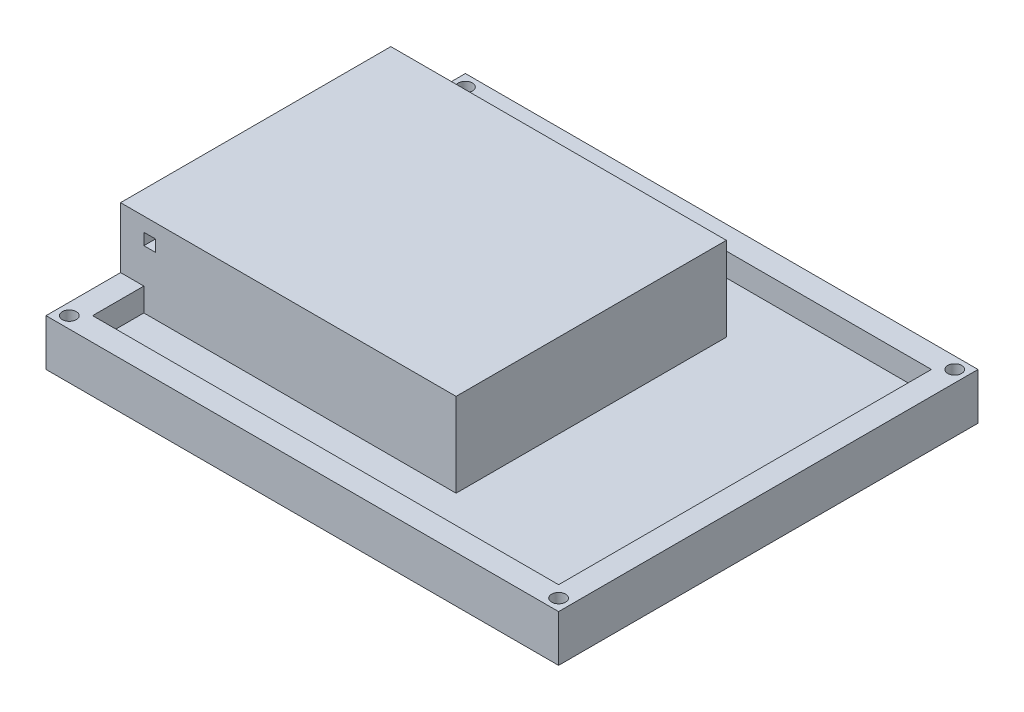
ISO-10303-21;
HEADER;
FILE_DESCRIPTION(('STEP AP214'),'2;1');
FILE_NAME('part.step','',(''),(''),'','','');
FILE_SCHEMA(('AUTOMOTIVE_DESIGN { 1 0 10303 214 1 1 1 1 }'));
ENDSEC;
DATA;
#1=APPLICATION_CONTEXT('core data for automotive mechanical design processes');
#2=APPLICATION_PROTOCOL_DEFINITION('international standard','automotive_design',2000,#1);
#3=PRODUCT_CONTEXT('',#1,'mechanical');
#4=PRODUCT('Part','Part','',(#3));
#5=PRODUCT_RELATED_PRODUCT_CATEGORY('part','',(#4));
#6=PRODUCT_DEFINITION_FORMATION('','',#4);
#7=PRODUCT_DEFINITION_CONTEXT('part definition',#1,'design');
#8=PRODUCT_DEFINITION('design','',#6,#7);
#9=PRODUCT_DEFINITION_SHAPE('','',#8);
#10=(LENGTH_UNIT() NAMED_UNIT(*) SI_UNIT(.MILLI.,.METRE.));
#11=(NAMED_UNIT(*) PLANE_ANGLE_UNIT() SI_UNIT($,.RADIAN.));
#12=(NAMED_UNIT(*) SI_UNIT($,.STERADIAN.) SOLID_ANGLE_UNIT());
#13=UNCERTAINTY_MEASURE_WITH_UNIT(LENGTH_MEASURE(1.E-05),#10,'distance_accuracy_value','');
#14=(GEOMETRIC_REPRESENTATION_CONTEXT(3) GLOBAL_UNCERTAINTY_ASSIGNED_CONTEXT((#13)) GLOBAL_UNIT_ASSIGNED_CONTEXT((#10,
#11,#12)) REPRESENTATION_CONTEXT('',''));
#15=CARTESIAN_POINT('',(0.,0.,0.));
#16=DIRECTION('',(0.,0.,1.));
#17=DIRECTION('',(1.,0.,0.));
#18=AXIS2_PLACEMENT_3D('',#15,#16,#17);
#19=CARTESIAN_POINT('',(0.,30.,29.));
#20=DIRECTION('',(0.,0.,1.));
#21=DIRECTION('',(1.,0.,0.));
#22=AXIS2_PLACEMENT_3D('',#19,#20,#21);
#23=PLANE('',#22);
#24=DIRECTION('',(1.,0.,0.));
#25=VECTOR('',#24,1.);
#26=CARTESIAN_POINT('',(15.,10.,29.));
#27=LINE('',#26,#25);
#28=CARTESIAN_POINT('',(-55.,10.,29.));
#29=VERTEX_POINT('',#28);
#30=CARTESIAN_POINT('',(-50.,10.,29.));
#31=VERTEX_POINT('',#30);
#32=EDGE_CURVE('E233',#29,#31,#27,.T.);
#33=ORIENTED_EDGE('',*,*,#32,.T.);
#34=DIRECTION('',(0.,-1.,0.));
#35=VECTOR('',#34,1.);
#36=CARTESIAN_POINT('',(-50.,10.,29.));
#37=LINE('',#36,#35);
#38=CARTESIAN_POINT('',(-50.,5.,29.));
#39=VERTEX_POINT('',#38);
#40=EDGE_CURVE('E259',#31,#39,#37,.T.);
#41=ORIENTED_EDGE('',*,*,#40,.T.);
#42=DIRECTION('',(-1.,0.,0.));
#43=VECTOR('',#42,1.);
#44=CARTESIAN_POINT('',(0.,5.,29.));
#45=LINE('',#44,#43);
#46=CARTESIAN_POINT('',(17.,5.,29.));
#47=VERTEX_POINT('',#46);
#48=EDGE_CURVE('E325',#47,#39,#45,.T.);
#49=ORIENTED_EDGE('',*,*,#48,.F.);
#50=DIRECTION('',(0.,-1.,0.));
#51=VECTOR('',#50,1.);
#52=CARTESIAN_POINT('',(17.,30.,29.));
#53=LINE('',#52,#51);
#54=CARTESIAN_POINT('',(17.,23.,29.));
#55=VERTEX_POINT('',#54);
#56=EDGE_CURVE('E338',#55,#47,#53,.T.);
#57=ORIENTED_EDGE('',*,*,#56,.F.);
#58=DIRECTION('',(1.,0.,0.));
#59=VECTOR('',#58,1.);
#60=CARTESIAN_POINT('',(15.,23.,29.));
#61=LINE('',#60,#59);
#62=CARTESIAN_POINT('',(-55.,23.,29.));
#63=VERTEX_POINT('',#62);
#64=EDGE_CURVE('E237',#63,#55,#61,.T.);
#65=ORIENTED_EDGE('',*,*,#64,.F.);
#66=DIRECTION('',(0.,-1.,0.));
#67=VECTOR('',#66,1.);
#68=CARTESIAN_POINT('',(-55.,23.,29.));
#69=LINE('',#68,#67);
#70=EDGE_CURVE('E235',#63,#29,#69,.T.);
#71=ORIENTED_EDGE('',*,*,#70,.T.);
#72=EDGE_LOOP('',(#33,#41,#49,#57,#65,#71));
#73=FACE_BOUND('',#72,.T.);
#74=DIRECTION('',(0.,-1.,0.));
#75=VECTOR('',#74,1.);
#76=CARTESIAN_POINT('',(-50.,0.,29.));
#77=LINE('',#76,#75);
#78=CARTESIAN_POINT('',(-50.,20.,29.));
#79=VERTEX_POINT('',#78);
#80=CARTESIAN_POINT('',(-50.,17.5,29.));
#81=VERTEX_POINT('',#80);
#82=EDGE_CURVE('E189',#79,#81,#77,.T.);
#83=ORIENTED_EDGE('',*,*,#82,.F.);
#84=DIRECTION('',(1.,0.,0.));
#85=VECTOR('',#84,1.);
#86=CARTESIAN_POINT('',(0.,20.,29.));
#87=LINE('',#86,#85);
#88=CARTESIAN_POINT('',(-47.5,20.,29.));
#89=VERTEX_POINT('',#88);
#90=EDGE_CURVE('E52',#79,#89,#87,.T.);
#91=ORIENTED_EDGE('',*,*,#90,.T.);
#92=DIRECTION('',(0.,-1.,0.));
#93=VECTOR('',#92,1.);
#94=CARTESIAN_POINT('',(-47.5,0.,29.));
#95=LINE('',#94,#93);
#96=CARTESIAN_POINT('',(-47.5,17.5,29.));
#97=VERTEX_POINT('',#96);
#98=EDGE_CURVE('E209',#89,#97,#95,.T.);
#99=ORIENTED_EDGE('',*,*,#98,.T.);
#100=DIRECTION('',(1.,0.,0.));
#101=VECTOR('',#100,1.);
#102=CARTESIAN_POINT('',(0.,17.5,29.));
#103=LINE('',#102,#101);
#104=EDGE_CURVE('E212',#81,#97,#103,.T.);
#105=ORIENTED_EDGE('',*,*,#104,.F.);
#106=EDGE_LOOP('',(#83,#91,#99,#105));
#107=FACE_BOUND('',#106,.T.);
#108=ADVANCED_FACE('F35',(#73,#107),#23,.T.);
#109=CARTESIAN_POINT('',(15.,0.,26.));
#110=DIRECTION('',(0.,0.,-1.));
#111=DIRECTION('',(0.,1.,0.));
#112=AXIS2_PLACEMENT_3D('',#109,#110,#111);
#113=PLANE('',#112);
#114=DIRECTION('',(1.,0.,0.));
#115=VECTOR('',#114,1.);
#116=CARTESIAN_POINT('',(0.,17.5,26.));
#117=LINE('',#116,#115);
#118=CARTESIAN_POINT('',(-50.,17.5,26.));
#119=VERTEX_POINT('',#118);
#120=CARTESIAN_POINT('',(-47.5,17.5,26.));
#121=VERTEX_POINT('',#120);
#122=EDGE_CURVE('E198',#119,#121,#117,.T.);
#123=ORIENTED_EDGE('',*,*,#122,.T.);
#124=DIRECTION('',(0.,-1.,0.));
#125=VECTOR('',#124,1.);
#126=CARTESIAN_POINT('',(-47.5,0.,26.));
#127=LINE('',#126,#125);
#128=CARTESIAN_POINT('',(-47.5,20.,26.));
#129=VERTEX_POINT('',#128);
#130=EDGE_CURVE('E202',#129,#121,#127,.T.);
#131=ORIENTED_EDGE('',*,*,#130,.F.);
#132=DIRECTION('',(1.,0.,0.));
#133=VECTOR('',#132,1.);
#134=CARTESIAN_POINT('',(15.,20.,26.0000000000001));
#135=LINE('',#134,#133);
#136=CARTESIAN_POINT('',(15.,20.,26.0000000000001));
#137=VERTEX_POINT('',#136);
#138=EDGE_CURVE('E231',#129,#137,#135,.T.);
#139=ORIENTED_EDGE('',*,*,#138,.T.);
#140=DIRECTION('',(0.,-1.,0.));
#141=VECTOR('',#140,1.);
#142=CARTESIAN_POINT('',(15.,0.,26.));
#143=LINE('',#142,#141);
#144=CARTESIAN_POINT('',(15.,0.,26.));
#145=VERTEX_POINT('',#144);
#146=EDGE_CURVE('E311',#137,#145,#143,.T.);
#147=ORIENTED_EDGE('',*,*,#146,.T.);
#148=DIRECTION('',(-1.,0.,0.));
#149=VECTOR('',#148,1.);
#150=CARTESIAN_POINT('',(15.,0.,26.));
#151=LINE('',#150,#149);
#152=CARTESIAN_POINT('',(-55.,0.,26.));
#153=VERTEX_POINT('',#152);
#154=EDGE_CURVE('E322',#145,#153,#151,.T.);
#155=ORIENTED_EDGE('',*,*,#154,.T.);
#156=DIRECTION('',(0.,-1.,0.));
#157=VECTOR('',#156,1.);
#158=CARTESIAN_POINT('',(-55.,0.,26.));
#159=LINE('',#158,#157);
#160=CARTESIAN_POINT('',(-55.,20.,26.0000000000001));
#161=VERTEX_POINT('',#160);
#162=EDGE_CURVE('E310',#161,#153,#159,.T.);
#163=ORIENTED_EDGE('',*,*,#162,.F.);
#164=CARTESIAN_POINT('',(-50.,20.,26.0000000000001));
#165=VERTEX_POINT('',#164);
#166=EDGE_CURVE('E208',#161,#165,#135,.T.);
#167=ORIENTED_EDGE('',*,*,#166,.T.);
#168=DIRECTION('',(0.,-1.,0.));
#169=VECTOR('',#168,1.);
#170=CARTESIAN_POINT('',(-50.,0.,26.));
#171=LINE('',#170,#169);
#172=EDGE_CURVE('E59',#165,#119,#171,.T.);
#173=ORIENTED_EDGE('',*,*,#172,.T.);
#174=EDGE_LOOP('',(#123,#131,#139,#147,#155,#163,#167,#173));
#175=FACE_BOUND('',#174,.T.);
#176=ADVANCED_FACE('F205',(#175),#113,.T.);
#177=CARTESIAN_POINT('',(55.,10.,-45.));
#178=DIRECTION('',(0.,-1.,0.));
#179=DIRECTION('',(0.,0.,-1.));
#180=AXIS2_PLACEMENT_3D('',#177,#178,#179);
#181=PLANE('',#180);
#182=CARTESIAN_POINT('',(-52.5,10.,42.5));
#183=DIRECTION('',(0.,-1.,0.));
#184=DIRECTION('',(0.,0.,-1.));
#185=AXIS2_PLACEMENT_3D('',#182,#183,#184);
#186=CIRCLE('',#185,1.5);
#187=CARTESIAN_POINT('',(-52.5,10.,41.));
#188=VERTEX_POINT('',#187);
#189=EDGE_CURVE('E277',#188,#188,#186,.F.);
#190=ORIENTED_EDGE('',*,*,#189,.F.);
#191=EDGE_LOOP('',(#190));
#192=FACE_BOUND('',#191,.T.);
#193=CARTESIAN_POINT('',(52.5,10.,42.5));
#194=DIRECTION('',(0.,-1.,0.));
#195=DIRECTION('',(0.,0.,-1.));
#196=AXIS2_PLACEMENT_3D('',#193,#194,#195);
#197=CIRCLE('',#196,1.5);
#198=CARTESIAN_POINT('',(52.5,10.,41.));
#199=VERTEX_POINT('',#198);
#200=EDGE_CURVE('E284',#199,#199,#197,.F.);
#201=ORIENTED_EDGE('',*,*,#200,.F.);
#202=EDGE_LOOP('',(#201));
#203=FACE_BOUND('',#202,.T.);
#204=CARTESIAN_POINT('',(52.5,10.,-42.5));
#205=DIRECTION('',(0.,-1.,0.));
#206=DIRECTION('',(0.,0.,-1.));
#207=AXIS2_PLACEMENT_3D('',#204,#205,#206);
#208=CIRCLE('',#207,1.5);
#209=CARTESIAN_POINT('',(52.5,10.,-44.));
#210=VERTEX_POINT('',#209);
#211=EDGE_CURVE('E295',#210,#210,#208,.F.);
#212=ORIENTED_EDGE('',*,*,#211,.F.);
#213=EDGE_LOOP('',(#212));
#214=FACE_BOUND('',#213,.T.);
#215=CARTESIAN_POINT('',(-52.5,10.,-42.5));
#216=DIRECTION('',(0.,-1.,0.));
#217=DIRECTION('',(0.,0.,-1.));
#218=AXIS2_PLACEMENT_3D('',#215,#216,#217);
#219=CIRCLE('',#218,1.5);
#220=CARTESIAN_POINT('',(-52.5,10.,-44.));
#221=VERTEX_POINT('',#220);
#222=EDGE_CURVE('E39',#221,#221,#219,.F.);
#223=ORIENTED_EDGE('',*,*,#222,.F.);
#224=EDGE_LOOP('',(#223));
#225=FACE_BOUND('',#224,.T.);
#226=ORIENTED_EDGE('',*,*,#32,.F.);
#227=DIRECTION('',(0.,0.,-1.));
#228=VECTOR('',#227,1.);
#229=CARTESIAN_POINT('',(-55.,10.,45.));
#230=LINE('',#229,#228);
#231=CARTESIAN_POINT('',(-55.,10.,45.));
#232=VERTEX_POINT('',#231);
#233=EDGE_CURVE('E272',#232,#29,#230,.T.);
#234=ORIENTED_EDGE('',*,*,#233,.F.);
#235=DIRECTION('',(-1.,0.,0.));
#236=VECTOR('',#235,1.);
#237=CARTESIAN_POINT('',(55.,10.,45.));
#238=LINE('',#237,#236);
#239=CARTESIAN_POINT('',(55.,10.,45.));
#240=VERTEX_POINT('',#239);
#241=EDGE_CURVE('E280',#240,#232,#238,.T.);
#242=ORIENTED_EDGE('',*,*,#241,.F.);
#243=DIRECTION('',(0.,0.,1.));
#244=VECTOR('',#243,1.);
#245=CARTESIAN_POINT('',(55.,10.,-45.));
#246=LINE('',#245,#244);
#247=CARTESIAN_POINT('',(55.,10.,-45.));
#248=VERTEX_POINT('',#247);
#249=EDGE_CURVE('E288',#248,#240,#246,.T.);
#250=ORIENTED_EDGE('',*,*,#249,.F.);
#251=DIRECTION('',(-1.,0.,0.));
#252=VECTOR('',#251,1.);
#253=CARTESIAN_POINT('',(55.,10.,-45.));
#254=LINE('',#253,#252);
#255=CARTESIAN_POINT('',(-55.,10.,-45.));
#256=VERTEX_POINT('',#255);
#257=EDGE_CURVE('E290',#248,#256,#254,.T.);
#258=ORIENTED_EDGE('',*,*,#257,.T.);
#259=DIRECTION('',(0.,0.,1.));
#260=VECTOR('',#259,1.);
#261=CARTESIAN_POINT('',(-55.,10.,-45.));
#262=LINE('',#261,#260);
#263=CARTESIAN_POINT('',(-55.,10.,-29.));
#264=VERTEX_POINT('',#263);
#265=EDGE_CURVE('E287',#256,#264,#262,.T.);
#266=ORIENTED_EDGE('',*,*,#265,.T.);
#267=DIRECTION('',(-1.,0.,0.));
#268=VECTOR('',#267,1.);
#269=CARTESIAN_POINT('',(17.,10.,-29.));
#270=LINE('',#269,#268);
#271=CARTESIAN_POINT('',(-50.,10.,-29.));
#272=VERTEX_POINT('',#271);
#273=EDGE_CURVE('E11',#272,#264,#270,.T.);
#274=ORIENTED_EDGE('',*,*,#273,.F.);
#275=DIRECTION('',(0.,0.,-1.));
#276=VECTOR('',#275,1.);
#277=CARTESIAN_POINT('',(-50.,10.,-40.));
#278=LINE('',#277,#276);
#279=CARTESIAN_POINT('',(-50.,10.,-40.));
#280=VERTEX_POINT('',#279);
#281=EDGE_CURVE('E262',#272,#280,#278,.T.);
#282=ORIENTED_EDGE('',*,*,#281,.T.);
#283=DIRECTION('',(-1.,0.,0.));
#284=VECTOR('',#283,1.);
#285=CARTESIAN_POINT('',(55.,10.,-40.));
#286=LINE('',#285,#284);
#287=CARTESIAN_POINT('',(50.,10.,-40.));
#288=VERTEX_POINT('',#287);
#289=EDGE_CURVE('E292',#288,#280,#286,.T.);
#290=ORIENTED_EDGE('',*,*,#289,.F.);
#291=DIRECTION('',(0.,0.,-1.));
#292=VECTOR('',#291,1.);
#293=CARTESIAN_POINT('',(50.,10.,45.));
#294=LINE('',#293,#292);
#295=CARTESIAN_POINT('',(50.,10.,40.));
#296=VERTEX_POINT('',#295);
#297=EDGE_CURVE('E282',#296,#288,#294,.T.);
#298=ORIENTED_EDGE('',*,*,#297,.F.);
#299=DIRECTION('',(1.,0.,0.));
#300=VECTOR('',#299,1.);
#301=CARTESIAN_POINT('',(-55.,10.,40.));
#302=LINE('',#301,#300);
#303=CARTESIAN_POINT('',(-50.,10.,40.));
#304=VERTEX_POINT('',#303);
#305=EDGE_CURVE('E275',#304,#296,#302,.T.);
#306=ORIENTED_EDGE('',*,*,#305,.F.);
#307=DIRECTION('',(0.,0.,-1.));
#308=VECTOR('',#307,1.);
#309=CARTESIAN_POINT('',(-50.,10.,29.));
#310=LINE('',#309,#308);
#311=EDGE_CURVE('E251',#304,#31,#310,.T.);
#312=ORIENTED_EDGE('',*,*,#311,.T.);
#313=EDGE_LOOP('',(#226,#234,#242,#250,#258,#266,#274,#282,#290,#298,#306,#312));
#314=FACE_BOUND('',#313,.T.);
#315=ADVANCED_FACE('F408',(#192,#203,#214,#225,#314),#181,.F.);
#316=CARTESIAN_POINT('',(15.,0.,0.));
#317=DIRECTION('',(-1.,0.,0.));
#318=DIRECTION('',(0.,0.,1.));
#319=AXIS2_PLACEMENT_3D('',#316,#317,#318);
#320=PLANE('',#319);
#321=DIRECTION('',(0.,0.,-1.));
#322=VECTOR('',#321,1.);
#323=CARTESIAN_POINT('',(15.,20.,-25.9999999999999));
#324=LINE('',#323,#322);
#325=CARTESIAN_POINT('',(15.,20.,-25.9999999999999));
#326=VERTEX_POINT('',#325);
#327=EDGE_CURVE('E221',#137,#326,#324,.T.);
#328=ORIENTED_EDGE('',*,*,#327,.T.);
#329=DIRECTION('',(0.,-1.,0.));
#330=VECTOR('',#329,1.);
#331=CARTESIAN_POINT('',(15.,0.,-25.9999999999999));
#332=LINE('',#331,#330);
#333=CARTESIAN_POINT('',(15.,0.,-25.9999999999999));
#334=VERTEX_POINT('',#333);
#335=EDGE_CURVE('E313',#326,#334,#332,.T.);
#336=ORIENTED_EDGE('',*,*,#335,.T.);
#337=DIRECTION('',(0.,0.,1.));
#338=VECTOR('',#337,1.);
#339=CARTESIAN_POINT('',(15.,0.,0.));
#340=LINE('',#339,#338);
#341=EDGE_CURVE('E316',#334,#145,#340,.T.);
#342=ORIENTED_EDGE('',*,*,#341,.T.);
#343=ORIENTED_EDGE('',*,*,#146,.F.);
#344=EDGE_LOOP('',(#328,#336,#342,#343));
#345=FACE_BOUND('',#344,.T.);
#346=ADVANCED_FACE('F399',(#345),#320,.T.);
#347=CARTESIAN_POINT('',(15.,0.,-25.9999999999999));
#348=DIRECTION('',(0.,0.,-1.));
#349=DIRECTION('',(0.,1.,0.));
#350=AXIS2_PLACEMENT_3D('',#347,#348,#349);
#351=PLANE('',#350);
#352=ORIENTED_EDGE('',*,*,#335,.F.);
#353=DIRECTION('',(-1.,0.,0.));
#354=VECTOR('',#353,1.);
#355=CARTESIAN_POINT('',(15.,20.,-25.9999999999999));
#356=LINE('',#355,#354);
#357=CARTESIAN_POINT('',(-55.,20.,-25.9999999999999));
#358=VERTEX_POINT('',#357);
#359=EDGE_CURVE('E226',#326,#358,#356,.T.);
#360=ORIENTED_EDGE('',*,*,#359,.T.);
#361=DIRECTION('',(0.,-1.,0.));
#362=VECTOR('',#361,1.);
#363=CARTESIAN_POINT('',(-55.,0.,-25.9999999999999));
#364=LINE('',#363,#362);
#365=CARTESIAN_POINT('',(-55.,0.,-25.9999999999999));
#366=VERTEX_POINT('',#365);
#367=EDGE_CURVE('E314',#358,#366,#364,.T.);
#368=ORIENTED_EDGE('',*,*,#367,.T.);
#369=DIRECTION('',(-1.,0.,0.));
#370=VECTOR('',#369,1.);
#371=CARTESIAN_POINT('',(15.,0.,-25.9999999999999));
#372=LINE('',#371,#370);
#373=EDGE_CURVE('E319',#334,#366,#372,.T.);
#374=ORIENTED_EDGE('',*,*,#373,.F.);
#375=EDGE_LOOP('',(#352,#360,#368,#374));
#376=FACE_BOUND('',#375,.T.);
#377=ADVANCED_FACE('F475',(#376),#351,.F.);
#378=CARTESIAN_POINT('',(0.,5.,0.));
#379=DIRECTION('',(0.,-1.,0.));
#380=DIRECTION('',(0.,0.,-1.));
#381=AXIS2_PLACEMENT_3D('',#378,#379,#380);
#382=PLANE('',#381);
#383=DIRECTION('',(0.,0.,-1.));
#384=VECTOR('',#383,1.);
#385=CARTESIAN_POINT('',(-50.,5.,29.));
#386=LINE('',#385,#384);
#387=CARTESIAN_POINT('',(-50.,5.,40.));
#388=VERTEX_POINT('',#387);
#389=EDGE_CURVE('E250',#388,#39,#386,.T.);
#390=ORIENTED_EDGE('',*,*,#389,.F.);
#391=DIRECTION('',(-1.,0.,0.));
#392=VECTOR('',#391,1.);
#393=CARTESIAN_POINT('',(-55.,5.,40.));
#394=LINE('',#393,#392);
#395=CARTESIAN_POINT('',(50.,5.,40.));
#396=VERTEX_POINT('',#395);
#397=EDGE_CURVE('E348',#396,#388,#394,.T.);
#398=ORIENTED_EDGE('',*,*,#397,.F.);
#399=DIRECTION('',(0.,0.,1.));
#400=VECTOR('',#399,1.);
#401=CARTESIAN_POINT('',(50.,5.,-40.));
#402=LINE('',#401,#400);
#403=CARTESIAN_POINT('',(50.,5.,-40.));
#404=VERTEX_POINT('',#403);
#405=EDGE_CURVE('E340',#404,#396,#402,.T.);
#406=ORIENTED_EDGE('',*,*,#405,.F.);
#407=DIRECTION('',(1.,0.,0.));
#408=VECTOR('',#407,1.);
#409=CARTESIAN_POINT('',(-55.,5.,-40.));
#410=LINE('',#409,#408);
#411=CARTESIAN_POINT('',(-50.,5.,-40.));
#412=VERTEX_POINT('',#411);
#413=EDGE_CURVE('E351',#412,#404,#410,.T.);
#414=ORIENTED_EDGE('',*,*,#413,.F.);
#415=DIRECTION('',(0.,0.,-1.));
#416=VECTOR('',#415,1.);
#417=CARTESIAN_POINT('',(-50.,5.,-40.));
#418=LINE('',#417,#416);
#419=CARTESIAN_POINT('',(-50.,5.,-29.));
#420=VERTEX_POINT('',#419);
#421=EDGE_CURVE('E261',#420,#412,#418,.T.);
#422=ORIENTED_EDGE('',*,*,#421,.F.);
#423=DIRECTION('',(1.,0.,0.));
#424=VECTOR('',#423,1.);
#425=CARTESIAN_POINT('',(0.,5.,-29.));
#426=LINE('',#425,#424);
#427=CARTESIAN_POINT('',(17.,5.,-29.));
#428=VERTEX_POINT('',#427);
#429=EDGE_CURVE('E333',#420,#428,#426,.T.);
#430=ORIENTED_EDGE('',*,*,#429,.T.);
#431=DIRECTION('',(0.,0.,1.));
#432=VECTOR('',#431,1.);
#433=CARTESIAN_POINT('',(17.,5.,0.));
#434=LINE('',#433,#432);
#435=EDGE_CURVE('E330',#428,#47,#434,.T.);
#436=ORIENTED_EDGE('',*,*,#435,.T.);
#437=ORIENTED_EDGE('',*,*,#48,.T.);
#438=EDGE_LOOP('',(#390,#398,#406,#414,#422,#430,#436,#437));
#439=FACE_BOUND('',#438,.T.);
#440=ADVANCED_FACE('F430',(#439),#382,.F.);
#441=CARTESIAN_POINT('',(-55.,30.,40.));
#442=DIRECTION('',(0.,0.,1.));
#443=DIRECTION('',(1.,0.,0.));
#444=AXIS2_PLACEMENT_3D('',#441,#442,#443);
#445=PLANE('',#444);
#446=DIRECTION('',(0.,-1.,0.));
#447=VECTOR('',#446,1.);
#448=CARTESIAN_POINT('',(-50.,10.,40.));
#449=LINE('',#448,#447);
#450=EDGE_CURVE('E254',#304,#388,#449,.T.);
#451=ORIENTED_EDGE('',*,*,#450,.F.);
#452=ORIENTED_EDGE('',*,*,#305,.T.);
#453=DIRECTION('',(0.,-1.,0.));
#454=VECTOR('',#453,1.);
#455=CARTESIAN_POINT('',(50.,30.,40.));
#456=LINE('',#455,#454);
#457=EDGE_CURVE('E343',#296,#396,#456,.T.);
#458=ORIENTED_EDGE('',*,*,#457,.T.);
#459=ORIENTED_EDGE('',*,*,#397,.T.);
#460=EDGE_LOOP('',(#451,#452,#458,#459));
#461=FACE_BOUND('',#460,.T.);
#462=ADVANCED_FACE('F433',(#461),#445,.F.);
#463=CARTESIAN_POINT('',(-55.,30.,-40.));
#464=DIRECTION('',(0.,0.,-1.));
#465=DIRECTION('',(-1.,0.,0.));
#466=AXIS2_PLACEMENT_3D('',#463,#464,#465);
#467=PLANE('',#466);
#468=DIRECTION('',(0.,-1.,0.));
#469=VECTOR('',#468,1.);
#470=CARTESIAN_POINT('',(-50.,10.,-40.));
#471=LINE('',#470,#469);
#472=EDGE_CURVE('E270',#280,#412,#471,.T.);
#473=ORIENTED_EDGE('',*,*,#472,.T.);
#474=ORIENTED_EDGE('',*,*,#413,.T.);
#475=DIRECTION('',(0.,-1.,0.));
#476=VECTOR('',#475,1.);
#477=CARTESIAN_POINT('',(50.,30.,-40.));
#478=LINE('',#477,#476);
#479=EDGE_CURVE('E345',#288,#404,#478,.T.);
#480=ORIENTED_EDGE('',*,*,#479,.F.);
#481=ORIENTED_EDGE('',*,*,#289,.T.);
#482=EDGE_LOOP('',(#473,#474,#480,#481));
#483=FACE_BOUND('',#482,.T.);
#484=ADVANCED_FACE('F423',(#483),#467,.F.);
#485=CARTESIAN_POINT('',(0.,30.,-29.));
#486=DIRECTION('',(0.,0.,-1.));
#487=DIRECTION('',(-1.,0.,0.));
#488=AXIS2_PLACEMENT_3D('',#485,#486,#487);
#489=PLANE('',#488);
#490=DIRECTION('',(0.,-1.,0.));
#491=VECTOR('',#490,1.);
#492=CARTESIAN_POINT('',(-50.,10.,-28.9999999999999));
#493=LINE('',#492,#491);
#494=EDGE_CURVE('E265',#272,#420,#493,.T.);
#495=ORIENTED_EDGE('',*,*,#494,.F.);
#496=ORIENTED_EDGE('',*,*,#273,.T.);
#497=DIRECTION('',(0.,-1.,0.));
#498=VECTOR('',#497,1.);
#499=CARTESIAN_POINT('',(-55.,23.,-29.));
#500=LINE('',#499,#498);
#501=CARTESIAN_POINT('',(-55.,23.,-29.));
#502=VERTEX_POINT('',#501);
#503=EDGE_CURVE('E246',#502,#264,#500,.T.);
#504=ORIENTED_EDGE('',*,*,#503,.F.);
#505=DIRECTION('',(-1.,0.,0.));
#506=VECTOR('',#505,1.);
#507=CARTESIAN_POINT('',(17.,23.,-29.));
#508=LINE('',#507,#506);
#509=CARTESIAN_POINT('',(17.,23.,-29.));
#510=VERTEX_POINT('',#509);
#511=EDGE_CURVE('E243',#510,#502,#508,.T.);
#512=ORIENTED_EDGE('',*,*,#511,.F.);
#513=DIRECTION('',(0.,-1.,0.));
#514=VECTOR('',#513,1.);
#515=CARTESIAN_POINT('',(17.,30.,-29.));
#516=LINE('',#515,#514);
#517=EDGE_CURVE('E336',#510,#428,#516,.T.);
#518=ORIENTED_EDGE('',*,*,#517,.T.);
#519=ORIENTED_EDGE('',*,*,#429,.F.);
#520=EDGE_LOOP('',(#495,#496,#504,#512,#518,#519));
#521=FACE_BOUND('',#520,.T.);
#522=ADVANCED_FACE('F411',(#521),#489,.T.);
#523=CARTESIAN_POINT('',(-55.,5.,45.));
#524=DIRECTION('',(1.,0.,0.));
#525=DIRECTION('',(0.,0.,-1.));
#526=AXIS2_PLACEMENT_3D('',#523,#524,#525);
#527=PLANE('',#526);
#528=ORIENTED_EDGE('',*,*,#367,.F.);
#529=DIRECTION('',(0.,0.,1.));
#530=VECTOR('',#529,1.);
#531=CARTESIAN_POINT('',(-55.,20.,-25.9999999999999));
#532=LINE('',#531,#530);
#533=EDGE_CURVE('E229',#358,#161,#532,.T.);
#534=ORIENTED_EDGE('',*,*,#533,.T.);
#535=ORIENTED_EDGE('',*,*,#162,.T.);
#536=DIRECTION('',(0.,0.,1.));
#537=VECTOR('',#536,1.);
#538=CARTESIAN_POINT('',(-55.,0.,45.));
#539=LINE('',#538,#537);
#540=CARTESIAN_POINT('',(-55.,0.,45.));
#541=VERTEX_POINT('',#540);
#542=EDGE_CURVE('E359',#153,#541,#539,.T.);
#543=ORIENTED_EDGE('',*,*,#542,.T.);
#544=DIRECTION('',(0.,-1.,0.));
#545=VECTOR('',#544,1.);
#546=CARTESIAN_POINT('',(-55.,5.,45.));
#547=LINE('',#546,#545);
#548=EDGE_CURVE('E368',#232,#541,#547,.T.);
#549=ORIENTED_EDGE('',*,*,#548,.F.);
#550=ORIENTED_EDGE('',*,*,#233,.T.);
#551=ORIENTED_EDGE('',*,*,#70,.F.);
#552=DIRECTION('',(0.,0.,1.));
#553=VECTOR('',#552,1.);
#554=CARTESIAN_POINT('',(-55.,23.,-29.));
#555=LINE('',#554,#553);
#556=EDGE_CURVE('E245',#502,#63,#555,.T.);
#557=ORIENTED_EDGE('',*,*,#556,.F.);
#558=ORIENTED_EDGE('',*,*,#503,.T.);
#559=ORIENTED_EDGE('',*,*,#265,.F.);
#560=DIRECTION('',(0.,-1.,0.));
#561=VECTOR('',#560,1.);
#562=CARTESIAN_POINT('',(-55.,5.,-45.));
#563=LINE('',#562,#561);
#564=CARTESIAN_POINT('',(-55.,0.,-45.));
#565=VERTEX_POINT('',#564);
#566=EDGE_CURVE('E370',#256,#565,#563,.T.);
#567=ORIENTED_EDGE('',*,*,#566,.T.);
#568=EDGE_CURVE('E360',#565,#366,#539,.T.);
#569=ORIENTED_EDGE('',*,*,#568,.T.);
#570=EDGE_LOOP('',(#528,#534,#535,#543,#549,#550,#551,#557,#558,#559,#567,#569));
#571=FACE_BOUND('',#570,.T.);
#572=ADVANCED_FACE('F394',(#571),#527,.F.);
#573=CARTESIAN_POINT('',(0.,0.,0.));
#574=DIRECTION('',(0.,-1.,0.));
#575=DIRECTION('',(0.,0.,-1.));
#576=AXIS2_PLACEMENT_3D('',#573,#574,#575);
#577=PLANE('',#576);
#578=CARTESIAN_POINT('',(-52.5,0.,-42.5));
#579=DIRECTION('',(0.,1.,0.));
#580=DIRECTION('',(0.,0.,1.));
#581=AXIS2_PLACEMENT_3D('',#578,#579,#580);
#582=CIRCLE('',#581,1.5);
#583=CARTESIAN_POINT('',(-52.5,0.,-41.));
#584=VERTEX_POINT('',#583);
#585=EDGE_CURVE('E298',#584,#584,#582,.T.);
#586=ORIENTED_EDGE('',*,*,#585,.T.);
#587=EDGE_LOOP('',(#586));
#588=FACE_BOUND('',#587,.T.);
#589=CARTESIAN_POINT('',(52.5,0.,-42.5));
#590=DIRECTION('',(0.,1.,0.));
#591=DIRECTION('',(0.,0.,1.));
#592=AXIS2_PLACEMENT_3D('',#589,#590,#591);
#593=CIRCLE('',#592,1.5);
#594=CARTESIAN_POINT('',(52.5,0.,-41.));
#595=VERTEX_POINT('',#594);
#596=EDGE_CURVE('E301',#595,#595,#593,.T.);
#597=ORIENTED_EDGE('',*,*,#596,.T.);
#598=EDGE_LOOP('',(#597));
#599=FACE_BOUND('',#598,.T.);
#600=CARTESIAN_POINT('',(-52.5,0.,42.5));
#601=DIRECTION('',(0.,1.,0.));
#602=DIRECTION('',(0.,0.,1.));
#603=AXIS2_PLACEMENT_3D('',#600,#601,#602);
#604=CIRCLE('',#603,1.5);
#605=CARTESIAN_POINT('',(-52.5,0.,44.));
#606=VERTEX_POINT('',#605);
#607=EDGE_CURVE('E304',#606,#606,#604,.T.);
#608=ORIENTED_EDGE('',*,*,#607,.T.);
#609=EDGE_LOOP('',(#608));
#610=FACE_BOUND('',#609,.T.);
#611=CARTESIAN_POINT('',(52.5,0.,42.5));
#612=DIRECTION('',(0.,1.,0.));
#613=DIRECTION('',(0.,0.,1.));
#614=AXIS2_PLACEMENT_3D('',#611,#612,#613);
#615=CIRCLE('',#614,1.5);
#616=CARTESIAN_POINT('',(52.5,0.,44.));
#617=VERTEX_POINT('',#616);
#618=EDGE_CURVE('E307',#617,#617,#615,.T.);
#619=ORIENTED_EDGE('',*,*,#618,.T.);
#620=EDGE_LOOP('',(#619));
#621=FACE_BOUND('',#620,.T.);
#622=ORIENTED_EDGE('',*,*,#542,.F.);
#623=ORIENTED_EDGE('',*,*,#154,.F.);
#624=ORIENTED_EDGE('',*,*,#341,.F.);
#625=ORIENTED_EDGE('',*,*,#373,.T.);
#626=ORIENTED_EDGE('',*,*,#568,.F.);
#627=DIRECTION('',(-1.,0.,0.));
#628=VECTOR('',#627,1.);
#629=CARTESIAN_POINT('',(-55.,0.,-45.));
#630=LINE('',#629,#628);
#631=CARTESIAN_POINT('',(55.,0.,-45.));
#632=VERTEX_POINT('',#631);
#633=EDGE_CURVE('E356',#632,#565,#630,.T.);
#634=ORIENTED_EDGE('',*,*,#633,.F.);
#635=DIRECTION('',(0.,0.,-1.));
#636=VECTOR('',#635,1.);
#637=CARTESIAN_POINT('',(55.,0.,45.));
#638=LINE('',#637,#636);
#639=CARTESIAN_POINT('',(55.,0.,45.));
#640=VERTEX_POINT('',#639);
#641=EDGE_CURVE('E353',#640,#632,#638,.T.);
#642=ORIENTED_EDGE('',*,*,#641,.F.);
#643=DIRECTION('',(1.,0.,0.));
#644=VECTOR('',#643,1.);
#645=CARTESIAN_POINT('',(-55.,0.,45.));
#646=LINE('',#645,#644);
#647=EDGE_CURVE('E363',#541,#640,#646,.T.);
#648=ORIENTED_EDGE('',*,*,#647,.F.);
#649=EDGE_LOOP('',(#622,#623,#624,#625,#626,#634,#642,#648));
#650=FACE_BOUND('',#649,.T.);
#651=ADVANCED_FACE('F382',(#588,#599,#610,#621,#650),#577,.T.);
#652=CARTESIAN_POINT('',(55.,5.,45.));
#653=DIRECTION('',(-1.,0.,0.));
#654=DIRECTION('',(0.,0.,1.));
#655=AXIS2_PLACEMENT_3D('',#652,#653,#654);
#656=PLANE('',#655);
#657=ORIENTED_EDGE('',*,*,#249,.T.);
#658=DIRECTION('',(0.,-1.,0.));
#659=VECTOR('',#658,1.);
#660=CARTESIAN_POINT('',(55.,5.,45.));
#661=LINE('',#660,#659);
#662=EDGE_CURVE('E366',#240,#640,#661,.T.);
#663=ORIENTED_EDGE('',*,*,#662,.T.);
#664=ORIENTED_EDGE('',*,*,#641,.T.);
#665=DIRECTION('',(0.,-1.,0.));
#666=VECTOR('',#665,1.);
#667=CARTESIAN_POINT('',(55.,5.,-45.));
#668=LINE('',#667,#666);
#669=EDGE_CURVE('E44',#248,#632,#668,.T.);
#670=ORIENTED_EDGE('',*,*,#669,.F.);
#671=EDGE_LOOP('',(#657,#663,#664,#670));
#672=FACE_BOUND('',#671,.T.);
#673=ADVANCED_FACE('F37',(#672),#656,.F.);
#674=CARTESIAN_POINT('',(-55.,5.,-45.));
#675=DIRECTION('',(0.,0.,1.));
#676=DIRECTION('',(1.,0.,0.));
#677=AXIS2_PLACEMENT_3D('',#674,#675,#676);
#678=PLANE('',#677);
#679=ORIENTED_EDGE('',*,*,#566,.F.);
#680=ORIENTED_EDGE('',*,*,#257,.F.);
#681=ORIENTED_EDGE('',*,*,#669,.T.);
#682=ORIENTED_EDGE('',*,*,#633,.T.);
#683=EDGE_LOOP('',(#679,#680,#681,#682));
#684=FACE_BOUND('',#683,.T.);
#685=ADVANCED_FACE('F376',(#684),#678,.F.);
#686=CARTESIAN_POINT('',(-55.,5.,45.));
#687=DIRECTION('',(0.,0.,-1.));
#688=DIRECTION('',(-1.,0.,0.));
#689=AXIS2_PLACEMENT_3D('',#686,#687,#688);
#690=PLANE('',#689);
#691=ORIENTED_EDGE('',*,*,#241,.T.);
#692=ORIENTED_EDGE('',*,*,#548,.T.);
#693=ORIENTED_EDGE('',*,*,#647,.T.);
#694=ORIENTED_EDGE('',*,*,#662,.F.);
#695=EDGE_LOOP('',(#691,#692,#693,#694));
#696=FACE_BOUND('',#695,.T.);
#697=ADVANCED_FACE('F387',(#696),#690,.F.);
#698=CARTESIAN_POINT('',(50.,30.,-40.));
#699=DIRECTION('',(1.,0.,0.));
#700=DIRECTION('',(0.,0.,-1.));
#701=AXIS2_PLACEMENT_3D('',#698,#699,#700);
#702=PLANE('',#701);
#703=ORIENTED_EDGE('',*,*,#457,.F.);
#704=ORIENTED_EDGE('',*,*,#297,.T.);
#705=ORIENTED_EDGE('',*,*,#479,.T.);
#706=ORIENTED_EDGE('',*,*,#405,.T.);
#707=EDGE_LOOP('',(#703,#704,#705,#706));
#708=FACE_BOUND('',#707,.T.);
#709=ADVANCED_FACE('F427',(#708),#702,.F.);
#710=CARTESIAN_POINT('',(17.,30.,0.));
#711=DIRECTION('',(1.,0.,0.));
#712=DIRECTION('',(0.,0.,-1.));
#713=AXIS2_PLACEMENT_3D('',#710,#711,#712);
#714=PLANE('',#713);
#715=DIRECTION('',(0.,0.,-1.));
#716=VECTOR('',#715,1.);
#717=CARTESIAN_POINT('',(17.,23.,-29.));
#718=LINE('',#717,#716);
#719=EDGE_CURVE('E240',#55,#510,#718,.T.);
#720=ORIENTED_EDGE('',*,*,#719,.F.);
#721=ORIENTED_EDGE('',*,*,#56,.T.);
#722=ORIENTED_EDGE('',*,*,#435,.F.);
#723=ORIENTED_EDGE('',*,*,#517,.F.);
#724=EDGE_LOOP('',(#720,#721,#722,#723));
#725=FACE_BOUND('',#724,.T.);
#726=ADVANCED_FACE('F449',(#725),#714,.T.);
#727=CARTESIAN_POINT('',(52.5,0.,42.5));
#728=DIRECTION('',(0.,1.,0.));
#729=DIRECTION('',(0.,0.,1.));
#730=AXIS2_PLACEMENT_3D('',#727,#728,#729);
#731=CYLINDRICAL_SURFACE('',#730,1.5);
#732=ORIENTED_EDGE('',*,*,#200,.T.);
#733=EDGE_LOOP('',(#732));
#734=FACE_BOUND('',#733,.T.);
#735=ORIENTED_EDGE('',*,*,#618,.F.);
#736=EDGE_LOOP('',(#735));
#737=FACE_BOUND('',#736,.T.);
#738=ADVANCED_FACE('F451',(#734,#737),#731,.F.);
#739=CARTESIAN_POINT('',(-52.5,0.,42.5));
#740=DIRECTION('',(0.,1.,0.));
#741=DIRECTION('',(0.,0.,1.));
#742=AXIS2_PLACEMENT_3D('',#739,#740,#741);
#743=CYLINDRICAL_SURFACE('',#742,1.5);
#744=ORIENTED_EDGE('',*,*,#189,.T.);
#745=EDGE_LOOP('',(#744));
#746=FACE_BOUND('',#745,.T.);
#747=ORIENTED_EDGE('',*,*,#607,.F.);
#748=EDGE_LOOP('',(#747));
#749=FACE_BOUND('',#748,.T.);
#750=ADVANCED_FACE('F457',(#746,#749),#743,.F.);
#751=CARTESIAN_POINT('',(52.5,0.,-42.5));
#752=DIRECTION('',(0.,1.,0.));
#753=DIRECTION('',(0.,0.,1.));
#754=AXIS2_PLACEMENT_3D('',#751,#752,#753);
#755=CYLINDRICAL_SURFACE('',#754,1.5);
#756=ORIENTED_EDGE('',*,*,#211,.T.);
#757=EDGE_LOOP('',(#756));
#758=FACE_BOUND('',#757,.T.);
#759=ORIENTED_EDGE('',*,*,#596,.F.);
#760=EDGE_LOOP('',(#759));
#761=FACE_BOUND('',#760,.T.);
#762=ADVANCED_FACE('F601',(#758,#761),#755,.F.);
#763=CARTESIAN_POINT('',(-52.5,0.,-42.5));
#764=DIRECTION('',(0.,1.,0.));
#765=DIRECTION('',(0.,0.,1.));
#766=AXIS2_PLACEMENT_3D('',#763,#764,#765);
#767=CYLINDRICAL_SURFACE('',#766,1.5);
#768=ORIENTED_EDGE('',*,*,#222,.T.);
#769=EDGE_LOOP('',(#768));
#770=FACE_BOUND('',#769,.T.);
#771=ORIENTED_EDGE('',*,*,#585,.F.);
#772=EDGE_LOOP('',(#771));
#773=FACE_BOUND('',#772,.T.);
#774=ADVANCED_FACE('F597',(#770,#773),#767,.F.);
#775=CARTESIAN_POINT('',(-50.,10.,-40.));
#776=DIRECTION('',(-1.,0.,0.));
#777=DIRECTION('',(0.,0.,1.));
#778=AXIS2_PLACEMENT_3D('',#775,#776,#777);
#779=PLANE('',#778);
#780=ORIENTED_EDGE('',*,*,#421,.T.);
#781=ORIENTED_EDGE('',*,*,#472,.F.);
#782=ORIENTED_EDGE('',*,*,#281,.F.);
#783=ORIENTED_EDGE('',*,*,#494,.T.);
#784=EDGE_LOOP('',(#780,#781,#782,#783));
#785=FACE_BOUND('',#784,.T.);
#786=ADVANCED_FACE('F417',(#785),#779,.F.);
#787=CARTESIAN_POINT('',(-50.,10.,29.));
#788=DIRECTION('',(-1.,0.,0.));
#789=DIRECTION('',(0.,0.,1.));
#790=AXIS2_PLACEMENT_3D('',#787,#788,#789);
#791=PLANE('',#790);
#792=ORIENTED_EDGE('',*,*,#389,.T.);
#793=ORIENTED_EDGE('',*,*,#40,.F.);
#794=ORIENTED_EDGE('',*,*,#311,.F.);
#795=ORIENTED_EDGE('',*,*,#450,.T.);
#796=EDGE_LOOP('',(#792,#793,#794,#795));
#797=FACE_BOUND('',#796,.T.);
#798=ADVANCED_FACE('F436',(#797),#791,.F.);
#799=CARTESIAN_POINT('',(0.,23.,0.));
#800=DIRECTION('',(0.,-1.,0.));
#801=DIRECTION('',(0.,0.,-1.));
#802=AXIS2_PLACEMENT_3D('',#799,#800,#801);
#803=PLANE('',#802);
#804=ORIENTED_EDGE('',*,*,#556,.T.);
#805=ORIENTED_EDGE('',*,*,#64,.T.);
#806=ORIENTED_EDGE('',*,*,#719,.T.);
#807=ORIENTED_EDGE('',*,*,#511,.T.);
#808=EDGE_LOOP('',(#804,#805,#806,#807));
#809=FACE_BOUND('',#808,.T.);
#810=ADVANCED_FACE('F446',(#809),#803,.F.);
#811=CARTESIAN_POINT('',(0.,20.,0.));
#812=DIRECTION('',(0.,-1.,0.));
#813=DIRECTION('',(0.,0.,-1.));
#814=AXIS2_PLACEMENT_3D('',#811,#812,#813);
#815=PLANE('',#814);
#816=ORIENTED_EDGE('',*,*,#327,.F.);
#817=ORIENTED_EDGE('',*,*,#138,.F.);
#818=DIRECTION('',(0.,0.,1.));
#819=VECTOR('',#818,1.);
#820=CARTESIAN_POINT('',(-47.5,20.,26.));
#821=LINE('',#820,#819);
#822=EDGE_CURVE('E219',#129,#89,#821,.T.);
#823=ORIENTED_EDGE('',*,*,#822,.T.);
#824=ORIENTED_EDGE('',*,*,#90,.F.);
#825=DIRECTION('',(0.,0.,1.));
#826=VECTOR('',#825,1.);
#827=CARTESIAN_POINT('',(-50.,20.,26.));
#828=LINE('',#827,#826);
#829=EDGE_CURVE('E194',#165,#79,#828,.T.);
#830=ORIENTED_EDGE('',*,*,#829,.F.);
#831=ORIENTED_EDGE('',*,*,#166,.F.);
#832=ORIENTED_EDGE('',*,*,#533,.F.);
#833=ORIENTED_EDGE('',*,*,#359,.F.);
#834=EDGE_LOOP('',(#816,#817,#823,#824,#830,#831,#832,#833));
#835=FACE_BOUND('',#834,.T.);
#836=ADVANCED_FACE('F551',(#835),#815,.T.);
#837=CARTESIAN_POINT('',(-47.5,0.,26.));
#838=DIRECTION('',(-1.,0.,0.));
#839=DIRECTION('',(0.,0.,1.));
#840=AXIS2_PLACEMENT_3D('',#837,#838,#839);
#841=PLANE('',#840);
#842=ORIENTED_EDGE('',*,*,#98,.F.);
#843=ORIENTED_EDGE('',*,*,#822,.F.);
#844=ORIENTED_EDGE('',*,*,#130,.T.);
#845=DIRECTION('',(0.,0.,1.));
#846=VECTOR('',#845,1.);
#847=CARTESIAN_POINT('',(-47.5,17.5,26.));
#848=LINE('',#847,#846);
#849=EDGE_CURVE('E193',#121,#97,#848,.T.);
#850=ORIENTED_EDGE('',*,*,#849,.T.);
#851=EDGE_LOOP('',(#842,#843,#844,#850));
#852=FACE_BOUND('',#851,.T.);
#853=ADVANCED_FACE('F556',(#852),#841,.T.);
#854=CARTESIAN_POINT('',(0.,17.5,26.));
#855=DIRECTION('',(0.,-1.,0.));
#856=DIRECTION('',(0.,0.,-1.));
#857=AXIS2_PLACEMENT_3D('',#854,#855,#856);
#858=PLANE('',#857);
#859=ORIENTED_EDGE('',*,*,#104,.T.);
#860=ORIENTED_EDGE('',*,*,#849,.F.);
#861=ORIENTED_EDGE('',*,*,#122,.F.);
#862=DIRECTION('',(0.,0.,1.));
#863=VECTOR('',#862,1.);
#864=CARTESIAN_POINT('',(-50.,17.5,26.));
#865=LINE('',#864,#863);
#866=EDGE_CURVE('E185',#119,#81,#865,.T.);
#867=ORIENTED_EDGE('',*,*,#866,.T.);
#868=EDGE_LOOP('',(#859,#860,#861,#867));
#869=FACE_BOUND('',#868,.T.);
#870=ADVANCED_FACE('F199',(#869),#858,.F.);
#871=CARTESIAN_POINT('',(-50.,0.,26.));
#872=DIRECTION('',(-1.,0.,0.));
#873=DIRECTION('',(0.,0.,1.));
#874=AXIS2_PLACEMENT_3D('',#871,#872,#873);
#875=PLANE('',#874);
#876=ORIENTED_EDGE('',*,*,#82,.T.);
#877=ORIENTED_EDGE('',*,*,#866,.F.);
#878=ORIENTED_EDGE('',*,*,#172,.F.);
#879=ORIENTED_EDGE('',*,*,#829,.T.);
#880=EDGE_LOOP('',(#876,#877,#878,#879));
#881=FACE_BOUND('',#880,.T.);
#882=ADVANCED_FACE('F187',(#881),#875,.F.);
#883=CLOSED_SHELL('',(#108,#176,#315,#346,#377,#440,#462,#484,#522,#572,#651,#673,#685,#697,
#709,#726,#738,#750,#762,#774,#786,#798,#810,#836,#853,#870,#882));
#884=MANIFOLD_SOLID_BREP('B2',#883);
#885=ADVANCED_BREP_SHAPE_REPRESENTATION('',(#18,#884),#14);
#886=SHAPE_DEFINITION_REPRESENTATION(#9,#885);
ENDSEC;
END-ISO-10303-21;
